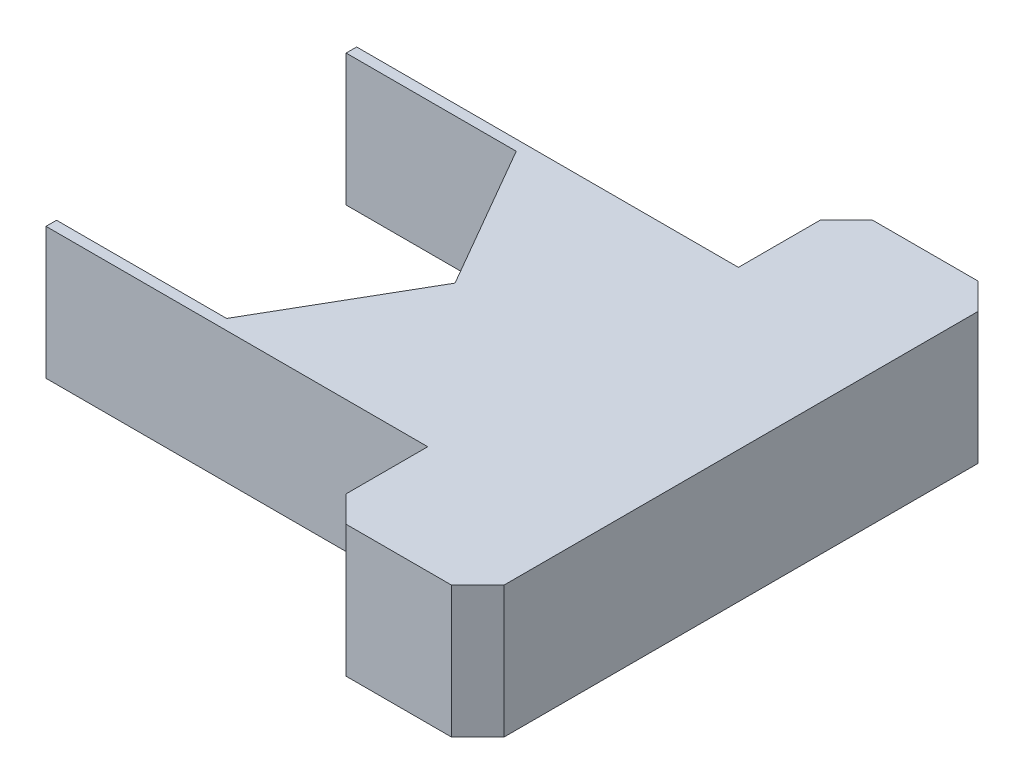
ISO-10303-21;
HEADER;
FILE_DESCRIPTION(('STEP AP214'),'2;1');
FILE_NAME('part.step','',(''),(''),'','','');
FILE_SCHEMA(('AUTOMOTIVE_DESIGN { 1 0 10303 214 1 1 1 1 }'));
ENDSEC;
DATA;
#1=APPLICATION_CONTEXT('core data for automotive mechanical design processes');
#2=APPLICATION_PROTOCOL_DEFINITION('international standard','automotive_design',2000,#1);
#3=PRODUCT_CONTEXT('',#1,'mechanical');
#4=PRODUCT('Part','Part','',(#3));
#5=PRODUCT_RELATED_PRODUCT_CATEGORY('part','',(#4));
#6=PRODUCT_DEFINITION_FORMATION('','',#4);
#7=PRODUCT_DEFINITION_CONTEXT('part definition',#1,'design');
#8=PRODUCT_DEFINITION('design','',#6,#7);
#9=PRODUCT_DEFINITION_SHAPE('','',#8);
#10=(LENGTH_UNIT() NAMED_UNIT(*) SI_UNIT(.MILLI.,.METRE.));
#11=(NAMED_UNIT(*) PLANE_ANGLE_UNIT() SI_UNIT($,.RADIAN.));
#12=(NAMED_UNIT(*) SI_UNIT($,.STERADIAN.) SOLID_ANGLE_UNIT());
#13=UNCERTAINTY_MEASURE_WITH_UNIT(LENGTH_MEASURE(1.E-05),#10,'distance_accuracy_value','');
#14=(GEOMETRIC_REPRESENTATION_CONTEXT(3) GLOBAL_UNCERTAINTY_ASSIGNED_CONTEXT((#13)) GLOBAL_UNIT_ASSIGNED_CONTEXT((#10,
#11,#12)) REPRESENTATION_CONTEXT('',''));
#15=CARTESIAN_POINT('',(0.,0.,0.));
#16=DIRECTION('',(0.,0.,1.));
#17=DIRECTION('',(1.,0.,0.));
#18=AXIS2_PLACEMENT_3D('',#15,#16,#17);
#19=CARTESIAN_POINT('',(2.4378615116532,2.5,-1.4075));
#20=DIRECTION('',(0.866025403784439,0.,-0.5));
#21=DIRECTION('',(-0.5,0.,-0.866025403784439));
#22=AXIS2_PLACEMENT_3D('',#19,#20,#21);
#23=PLANE('',#22);
#24=DIRECTION('',(0.5,0.,0.866025403784439));
#25=VECTOR('',#24,1.);
#26=CARTESIAN_POINT('',(2.4378615116532,0.,-1.4075));
#27=LINE('',#26,#25);
#28=CARTESIAN_POINT('',(1.66276877526612,0.,-2.75));
#29=VERTEX_POINT('',#28);
#30=CARTESIAN_POINT('',(3.2504820155376,0.,0.));
#31=VERTEX_POINT('',#30);
#32=EDGE_CURVE('E195',#29,#31,#27,.T.);
#33=ORIENTED_EDGE('',*,*,#32,.T.);
#34=DIRECTION('',(0.,-1.,0.));
#35=VECTOR('',#34,1.);
#36=CARTESIAN_POINT('',(3.2504820155376,2.5,0.));
#37=LINE('',#36,#35);
#38=CARTESIAN_POINT('',(3.2504820155376,2.5,0.));
#39=VERTEX_POINT('',#38);
#40=EDGE_CURVE('E174',#39,#31,#37,.T.);
#41=ORIENTED_EDGE('',*,*,#40,.F.);
#42=DIRECTION('',(0.5,0.,0.866025403784439));
#43=VECTOR('',#42,1.);
#44=CARTESIAN_POINT('',(2.4378615116532,2.5,-1.4075));
#45=LINE('',#44,#43);
#46=CARTESIAN_POINT('',(1.66276877526612,2.5,-2.75));
#47=VERTEX_POINT('',#46);
#48=EDGE_CURVE('E181',#47,#39,#45,.T.);
#49=ORIENTED_EDGE('',*,*,#48,.F.);
#50=DIRECTION('',(0.,-1.,0.));
#51=VECTOR('',#50,1.);
#52=CARTESIAN_POINT('',(1.66276877526612,2.5,-2.75));
#53=LINE('',#52,#51);
#54=EDGE_CURVE('E283',#47,#29,#53,.T.);
#55=ORIENTED_EDGE('',*,*,#54,.T.);
#56=EDGE_LOOP('',(#33,#41,#49,#55));
#57=FACE_BOUND('',#56,.T.);
#58=ADVANCED_FACE('F47',(#57),#23,.F.);
#59=CARTESIAN_POINT('',(2.4378615116532,2.5,1.4075));
#60=DIRECTION('',(0.866025403784439,0.,0.5));
#61=DIRECTION('',(0.5,0.,-0.866025403784439));
#62=AXIS2_PLACEMENT_3D('',#59,#60,#61);
#63=PLANE('',#62);
#64=DIRECTION('',(-0.5,0.,0.866025403784439));
#65=VECTOR('',#64,1.);
#66=CARTESIAN_POINT('',(2.4378615116532,0.,1.4075));
#67=LINE('',#66,#65);
#68=CARTESIAN_POINT('',(1.66276877526612,0.,2.75));
#69=VERTEX_POINT('',#68);
#70=EDGE_CURVE('E317',#31,#69,#67,.T.);
#71=ORIENTED_EDGE('',*,*,#70,.T.);
#72=DIRECTION('',(0.,-1.,0.));
#73=VECTOR('',#72,1.);
#74=CARTESIAN_POINT('',(1.66276877526612,2.5,2.75));
#75=LINE('',#74,#73);
#76=CARTESIAN_POINT('',(1.66276877526612,2.5,2.75));
#77=VERTEX_POINT('',#76);
#78=EDGE_CURVE('E176',#77,#69,#75,.T.);
#79=ORIENTED_EDGE('',*,*,#78,.F.);
#80=DIRECTION('',(-0.5,0.,0.866025403784439));
#81=VECTOR('',#80,1.);
#82=CARTESIAN_POINT('',(2.4378615116532,2.5,1.4075));
#83=LINE('',#82,#81);
#84=EDGE_CURVE('E169',#39,#77,#83,.T.);
#85=ORIENTED_EDGE('',*,*,#84,.F.);
#86=ORIENTED_EDGE('',*,*,#40,.T.);
#87=EDGE_LOOP('',(#71,#79,#85,#86));
#88=FACE_BOUND('',#87,.T.);
#89=ADVANCED_FACE('F172',(#88),#63,.F.);
#90=CARTESIAN_POINT('',(0.,2.5,2.75));
#91=DIRECTION('',(0.,0.,-1.));
#92=DIRECTION('',(-1.,0.,0.));
#93=AXIS2_PLACEMENT_3D('',#90,#91,#92);
#94=PLANE('',#93);
#95=DIRECTION('',(1.,0.,0.));
#96=VECTOR('',#95,1.);
#97=CARTESIAN_POINT('',(0.,0.,2.75));
#98=LINE('',#97,#96);
#99=CARTESIAN_POINT('',(-1.56750598084984,0.,2.75));
#100=VERTEX_POINT('',#99);
#101=EDGE_CURVE('E314',#100,#69,#98,.T.);
#102=ORIENTED_EDGE('',*,*,#101,.F.);
#103=DIRECTION('',(0.,-1.,0.));
#104=VECTOR('',#103,1.);
#105=CARTESIAN_POINT('',(-1.56750598084984,2.5,2.75));
#106=LINE('',#105,#104);
#107=CARTESIAN_POINT('',(-1.56750598084984,2.5,2.75));
#108=VERTEX_POINT('',#107);
#109=EDGE_CURVE('E203',#108,#100,#106,.T.);
#110=ORIENTED_EDGE('',*,*,#109,.F.);
#111=DIRECTION('',(1.,0.,0.));
#112=VECTOR('',#111,1.);
#113=CARTESIAN_POINT('',(0.,2.5,2.75));
#114=LINE('',#113,#112);
#115=EDGE_CURVE('E180',#108,#77,#114,.T.);
#116=ORIENTED_EDGE('',*,*,#115,.T.);
#117=ORIENTED_EDGE('',*,*,#78,.T.);
#118=EDGE_LOOP('',(#102,#110,#116,#117));
#119=FACE_BOUND('',#118,.T.);
#120=ADVANCED_FACE('F315',(#119),#94,.T.);
#121=CARTESIAN_POINT('',(-1.56750598084984,2.5,0.));
#122=DIRECTION('',(-1.,0.,0.));
#123=DIRECTION('',(0.,0.,1.));
#124=AXIS2_PLACEMENT_3D('',#121,#122,#123);
#125=PLANE('',#124);
#126=DIRECTION('',(0.,0.,-1.));
#127=VECTOR('',#126,1.);
#128=CARTESIAN_POINT('',(-1.56750598084984,0.,0.));
#129=LINE('',#128,#127);
#130=CARTESIAN_POINT('',(-1.56750598084984,0.,2.95));
#131=VERTEX_POINT('',#130);
#132=EDGE_CURVE('E308',#131,#100,#129,.T.);
#133=ORIENTED_EDGE('',*,*,#132,.F.);
#134=DIRECTION('',(0.,-1.,0.));
#135=VECTOR('',#134,1.);
#136=CARTESIAN_POINT('',(-1.56750598084984,2.5,2.95));
#137=LINE('',#136,#135);
#138=CARTESIAN_POINT('',(-1.56750598084984,2.5,2.95));
#139=VERTEX_POINT('',#138);
#140=EDGE_CURVE('E299',#139,#131,#137,.T.);
#141=ORIENTED_EDGE('',*,*,#140,.F.);
#142=DIRECTION('',(0.,0.,-1.));
#143=VECTOR('',#142,1.);
#144=CARTESIAN_POINT('',(-1.56750598084984,2.5,0.));
#145=LINE('',#144,#143);
#146=EDGE_CURVE('E311',#139,#108,#145,.T.);
#147=ORIENTED_EDGE('',*,*,#146,.T.);
#148=ORIENTED_EDGE('',*,*,#109,.T.);
#149=EDGE_LOOP('',(#133,#141,#147,#148));
#150=FACE_BOUND('',#149,.T.);
#151=ADVANCED_FACE('F306',(#150),#125,.T.);
#152=CARTESIAN_POINT('',(0.,2.5,2.95));
#153=DIRECTION('',(0.,0.,1.));
#154=DIRECTION('',(1.,0.,0.));
#155=AXIS2_PLACEMENT_3D('',#152,#153,#154);
#156=PLANE('',#155);
#157=DIRECTION('',(-1.,0.,0.));
#158=VECTOR('',#157,1.);
#159=CARTESIAN_POINT('',(0.,0.,2.95));
#160=LINE('',#159,#158);
#161=CARTESIAN_POINT('',(5.68249401915016,0.,2.95));
#162=VERTEX_POINT('',#161);
#163=EDGE_CURVE('E321',#162,#131,#160,.T.);
#164=ORIENTED_EDGE('',*,*,#163,.F.);
#165=DIRECTION('',(0.,-1.,0.));
#166=VECTOR('',#165,1.);
#167=CARTESIAN_POINT('',(5.68249401915016,2.5,2.95));
#168=LINE('',#167,#166);
#169=CARTESIAN_POINT('',(5.68249401915016,2.5,2.95));
#170=VERTEX_POINT('',#169);
#171=EDGE_CURVE('E296',#170,#162,#168,.T.);
#172=ORIENTED_EDGE('',*,*,#171,.F.);
#173=DIRECTION('',(-1.,0.,0.));
#174=VECTOR('',#173,1.);
#175=CARTESIAN_POINT('',(0.,2.5,2.95));
#176=LINE('',#175,#174);
#177=EDGE_CURVE('E421',#170,#139,#176,.T.);
#178=ORIENTED_EDGE('',*,*,#177,.T.);
#179=ORIENTED_EDGE('',*,*,#140,.T.);
#180=EDGE_LOOP('',(#164,#172,#178,#179));
#181=FACE_BOUND('',#180,.T.);
#182=ADVANCED_FACE('F432',(#181),#156,.T.);
#183=CARTESIAN_POINT('',(5.68249401915016,2.5,0.));
#184=DIRECTION('',(1.,0.,0.));
#185=DIRECTION('',(0.,0.,-1.));
#186=AXIS2_PLACEMENT_3D('',#183,#184,#185);
#187=PLANE('',#186);
#188=DIRECTION('',(0.,0.,1.));
#189=VECTOR('',#188,1.);
#190=CARTESIAN_POINT('',(5.68249401915016,0.,0.));
#191=LINE('',#190,#189);
#192=CARTESIAN_POINT('',(5.68249401915016,0.,4.5));
#193=VERTEX_POINT('',#192);
#194=EDGE_CURVE('E268',#162,#193,#191,.T.);
#195=ORIENTED_EDGE('',*,*,#194,.T.);
#196=DIRECTION('',(0.,1.,0.));
#197=VECTOR('',#196,1.);
#198=CARTESIAN_POINT('',(5.68249401915016,2.5,4.5));
#199=LINE('',#198,#197);
#200=CARTESIAN_POINT('',(5.68249401915016,2.5,4.5));
#201=VERTEX_POINT('',#200);
#202=EDGE_CURVE('E239',#193,#201,#199,.T.);
#203=ORIENTED_EDGE('',*,*,#202,.T.);
#204=DIRECTION('',(0.,0.,1.));
#205=VECTOR('',#204,1.);
#206=CARTESIAN_POINT('',(5.68249401915016,2.5,0.));
#207=LINE('',#206,#205);
#208=EDGE_CURVE('E353',#170,#201,#207,.T.);
#209=ORIENTED_EDGE('',*,*,#208,.F.);
#210=ORIENTED_EDGE('',*,*,#171,.T.);
#211=EDGE_LOOP('',(#195,#203,#209,#210));
#212=FACE_BOUND('',#211,.T.);
#213=ADVANCED_FACE('F433',(#212),#187,.F.);
#214=CARTESIAN_POINT('',(0.,2.5,5.));
#215=DIRECTION('',(0.,0.,-1.));
#216=DIRECTION('',(-1.,0.,0.));
#217=AXIS2_PLACEMENT_3D('',#214,#215,#216);
#218=PLANE('',#217);
#219=DIRECTION('',(1.,0.,0.));
#220=VECTOR('',#219,1.);
#221=CARTESIAN_POINT('',(0.,0.,5.));
#222=LINE('',#221,#220);
#223=CARTESIAN_POINT('',(6.18249401915017,0.,5.));
#224=VERTEX_POINT('',#223);
#225=CARTESIAN_POINT('',(8.18249401915016,0.,5.));
#226=VERTEX_POINT('',#225);
#227=EDGE_CURVE('E269',#224,#226,#222,.T.);
#228=ORIENTED_EDGE('',*,*,#227,.T.);
#229=DIRECTION('',(0.,1.,0.));
#230=VECTOR('',#229,1.);
#231=CARTESIAN_POINT('',(8.18249401915016,2.5,5.));
#232=LINE('',#231,#230);
#233=CARTESIAN_POINT('',(8.18249401915016,2.5,5.));
#234=VERTEX_POINT('',#233);
#235=EDGE_CURVE('E226',#226,#234,#232,.T.);
#236=ORIENTED_EDGE('',*,*,#235,.T.);
#237=DIRECTION('',(1.,0.,0.));
#238=VECTOR('',#237,1.);
#239=CARTESIAN_POINT('',(0.,2.5,5.));
#240=LINE('',#239,#238);
#241=CARTESIAN_POINT('',(6.18249401915017,2.5,5.));
#242=VERTEX_POINT('',#241);
#243=EDGE_CURVE('E343',#242,#234,#240,.T.);
#244=ORIENTED_EDGE('',*,*,#243,.F.);
#245=DIRECTION('',(0.,-1.,0.));
#246=VECTOR('',#245,1.);
#247=CARTESIAN_POINT('',(6.18249401915017,2.5,5.));
#248=LINE('',#247,#246);
#249=EDGE_CURVE('E222',#242,#224,#248,.T.);
#250=ORIENTED_EDGE('',*,*,#249,.T.);
#251=EDGE_LOOP('',(#228,#236,#244,#250));
#252=FACE_BOUND('',#251,.T.);
#253=ADVANCED_FACE('F334',(#252),#218,.F.);
#254=CARTESIAN_POINT('',(8.68249401915016,2.5,0.));
#255=DIRECTION('',(1.,0.,0.));
#256=DIRECTION('',(0.,0.,-1.));
#257=AXIS2_PLACEMENT_3D('',#254,#255,#256);
#258=PLANE('',#257);
#259=DIRECTION('',(0.,0.,1.));
#260=VECTOR('',#259,1.);
#261=CARTESIAN_POINT('',(8.68249401915016,2.5,0.));
#262=LINE('',#261,#260);
#263=CARTESIAN_POINT('',(8.68249401915016,2.5,-4.5));
#264=VERTEX_POINT('',#263);
#265=CARTESIAN_POINT('',(8.68249401915017,2.5,4.5));
#266=VERTEX_POINT('',#265);
#267=EDGE_CURVE('E342',#264,#266,#262,.T.);
#268=ORIENTED_EDGE('',*,*,#267,.T.);
#269=DIRECTION('',(0.,-1.,0.));
#270=VECTOR('',#269,1.);
#271=CARTESIAN_POINT('',(8.68249401915017,0.,4.5));
#272=LINE('',#271,#270);
#273=CARTESIAN_POINT('',(8.68249401915017,0.,4.5));
#274=VERTEX_POINT('',#273);
#275=EDGE_CURVE('E201',#266,#274,#272,.T.);
#276=ORIENTED_EDGE('',*,*,#275,.T.);
#277=DIRECTION('',(0.,0.,1.));
#278=VECTOR('',#277,1.);
#279=CARTESIAN_POINT('',(8.68249401915016,0.,0.));
#280=LINE('',#279,#278);
#281=CARTESIAN_POINT('',(8.68249401915016,0.,-4.5));
#282=VERTEX_POINT('',#281);
#283=EDGE_CURVE('E262',#282,#274,#280,.T.);
#284=ORIENTED_EDGE('',*,*,#283,.F.);
#285=DIRECTION('',(0.,1.,0.));
#286=VECTOR('',#285,1.);
#287=CARTESIAN_POINT('',(8.68249401915016,2.5,-4.5));
#288=LINE('',#287,#286);
#289=EDGE_CURVE('E197',#282,#264,#288,.T.);
#290=ORIENTED_EDGE('',*,*,#289,.T.);
#291=EDGE_LOOP('',(#268,#276,#284,#290));
#292=FACE_BOUND('',#291,.T.);
#293=ADVANCED_FACE('F345',(#292),#258,.T.);
#294=CARTESIAN_POINT('',(0.,2.5,-5.));
#295=DIRECTION('',(0.,0.,-1.));
#296=DIRECTION('',(-1.,0.,0.));
#297=AXIS2_PLACEMENT_3D('',#294,#295,#296);
#298=PLANE('',#297);
#299=DIRECTION('',(1.,0.,0.));
#300=VECTOR('',#299,1.);
#301=CARTESIAN_POINT('',(0.,2.5,-5.));
#302=LINE('',#301,#300);
#303=CARTESIAN_POINT('',(6.18249401915017,2.5,-5.));
#304=VERTEX_POINT('',#303);
#305=CARTESIAN_POINT('',(8.18249401915016,2.5,-5.));
#306=VERTEX_POINT('',#305);
#307=EDGE_CURVE('E253',#304,#306,#302,.T.);
#308=ORIENTED_EDGE('',*,*,#307,.T.);
#309=DIRECTION('',(0.,-1.,0.));
#310=VECTOR('',#309,1.);
#311=CARTESIAN_POINT('',(8.18249401915016,2.5,-5.));
#312=LINE('',#311,#310);
#313=CARTESIAN_POINT('',(8.18249401915016,0.,-5.));
#314=VERTEX_POINT('',#313);
#315=EDGE_CURVE('E57',#306,#314,#312,.T.);
#316=ORIENTED_EDGE('',*,*,#315,.T.);
#317=DIRECTION('',(1.,0.,0.));
#318=VECTOR('',#317,1.);
#319=CARTESIAN_POINT('',(0.,0.,-5.));
#320=LINE('',#319,#318);
#321=CARTESIAN_POINT('',(6.18249401915017,0.,-5.));
#322=VERTEX_POINT('',#321);
#323=EDGE_CURVE('E251',#322,#314,#320,.T.);
#324=ORIENTED_EDGE('',*,*,#323,.F.);
#325=DIRECTION('',(0.,1.,0.));
#326=VECTOR('',#325,1.);
#327=CARTESIAN_POINT('',(6.18249401915017,2.5,-5.));
#328=LINE('',#327,#326);
#329=EDGE_CURVE('E242',#322,#304,#328,.T.);
#330=ORIENTED_EDGE('',*,*,#329,.T.);
#331=EDGE_LOOP('',(#308,#316,#324,#330));
#332=FACE_BOUND('',#331,.T.);
#333=ADVANCED_FACE('F250',(#332),#298,.T.);
#334=CARTESIAN_POINT('',(5.68249401915016,2.5,-4.5));
#335=VERTEX_POINT('',#334);
#336=CARTESIAN_POINT('',(5.68249401915016,2.5,-2.95));
#337=VERTEX_POINT('',#336);
#338=EDGE_CURVE('E351',#335,#337,#207,.T.);
#339=ORIENTED_EDGE('',*,*,#338,.F.);
#340=DIRECTION('',(0.,-1.,0.));
#341=VECTOR('',#340,1.);
#342=CARTESIAN_POINT('',(5.68249401915016,0.,-4.5));
#343=LINE('',#342,#341);
#344=CARTESIAN_POINT('',(5.68249401915016,0.,-4.5));
#345=VERTEX_POINT('',#344);
#346=EDGE_CURVE('E11',#335,#345,#343,.T.);
#347=ORIENTED_EDGE('',*,*,#346,.T.);
#348=CARTESIAN_POINT('',(5.68249401915016,0.,-2.95));
#349=VERTEX_POINT('',#348);
#350=EDGE_CURVE('E261',#345,#349,#191,.T.);
#351=ORIENTED_EDGE('',*,*,#350,.T.);
#352=DIRECTION('',(0.,-1.,0.));
#353=VECTOR('',#352,1.);
#354=CARTESIAN_POINT('',(5.68249401915016,2.5,-2.95));
#355=LINE('',#354,#353);
#356=EDGE_CURVE('E292',#337,#349,#355,.T.);
#357=ORIENTED_EDGE('',*,*,#356,.F.);
#358=EDGE_LOOP('',(#339,#347,#351,#357));
#359=FACE_BOUND('',#358,.T.);
#360=ADVANCED_FACE('F381',(#359),#187,.F.);
#361=CARTESIAN_POINT('',(0.,2.5,-2.95));
#362=DIRECTION('',(0.,0.,-1.));
#363=DIRECTION('',(-1.,0.,0.));
#364=AXIS2_PLACEMENT_3D('',#361,#362,#363);
#365=PLANE('',#364);
#366=DIRECTION('',(1.,0.,0.));
#367=VECTOR('',#366,1.);
#368=CARTESIAN_POINT('',(0.,0.,-2.95));
#369=LINE('',#368,#367);
#370=CARTESIAN_POINT('',(-1.56750598084984,0.,-2.95));
#371=VERTEX_POINT('',#370);
#372=EDGE_CURVE('E266',#371,#349,#369,.T.);
#373=ORIENTED_EDGE('',*,*,#372,.F.);
#374=DIRECTION('',(0.,-1.,0.));
#375=VECTOR('',#374,1.);
#376=CARTESIAN_POINT('',(-1.56750598084984,2.5,-2.95));
#377=LINE('',#376,#375);
#378=CARTESIAN_POINT('',(-1.56750598084984,2.5,-2.95));
#379=VERTEX_POINT('',#378);
#380=EDGE_CURVE('E289',#379,#371,#377,.T.);
#381=ORIENTED_EDGE('',*,*,#380,.F.);
#382=DIRECTION('',(1.,0.,0.));
#383=VECTOR('',#382,1.);
#384=CARTESIAN_POINT('',(0.,2.5,-2.95));
#385=LINE('',#384,#383);
#386=EDGE_CURVE('E357',#379,#337,#385,.T.);
#387=ORIENTED_EDGE('',*,*,#386,.T.);
#388=ORIENTED_EDGE('',*,*,#356,.T.);
#389=EDGE_LOOP('',(#373,#381,#387,#388));
#390=FACE_BOUND('',#389,.T.);
#391=ADVANCED_FACE('F377',(#390),#365,.T.);
#392=CARTESIAN_POINT('',(-1.56750598084984,2.5,0.));
#393=DIRECTION('',(-1.,0.,0.));
#394=DIRECTION('',(0.,0.,1.));
#395=AXIS2_PLACEMENT_3D('',#392,#393,#394);
#396=PLANE('',#395);
#397=DIRECTION('',(0.,0.,-1.));
#398=VECTOR('',#397,1.);
#399=CARTESIAN_POINT('',(-1.56750598084984,0.,0.));
#400=LINE('',#399,#398);
#401=CARTESIAN_POINT('',(-1.56750598084984,0.,-2.75));
#402=VERTEX_POINT('',#401);
#403=EDGE_CURVE('E276',#402,#371,#400,.T.);
#404=ORIENTED_EDGE('',*,*,#403,.F.);
#405=DIRECTION('',(0.,-1.,0.));
#406=VECTOR('',#405,1.);
#407=CARTESIAN_POINT('',(-1.56750598084984,2.5,-2.75));
#408=LINE('',#407,#406);
#409=CARTESIAN_POINT('',(-1.56750598084984,2.5,-2.75));
#410=VERTEX_POINT('',#409);
#411=EDGE_CURVE('E286',#410,#402,#408,.T.);
#412=ORIENTED_EDGE('',*,*,#411,.F.);
#413=DIRECTION('',(0.,0.,-1.));
#414=VECTOR('',#413,1.);
#415=CARTESIAN_POINT('',(-1.56750598084984,2.5,0.));
#416=LINE('',#415,#414);
#417=EDGE_CURVE('E361',#410,#379,#416,.T.);
#418=ORIENTED_EDGE('',*,*,#417,.T.);
#419=ORIENTED_EDGE('',*,*,#380,.T.);
#420=EDGE_LOOP('',(#404,#412,#418,#419));
#421=FACE_BOUND('',#420,.T.);
#422=ADVANCED_FACE('F374',(#421),#396,.T.);
#423=CARTESIAN_POINT('',(0.,2.5,-2.75));
#424=DIRECTION('',(0.,0.,1.));
#425=DIRECTION('',(1.,0.,0.));
#426=AXIS2_PLACEMENT_3D('',#423,#424,#425);
#427=PLANE('',#426);
#428=DIRECTION('',(-1.,0.,0.));
#429=VECTOR('',#428,1.);
#430=CARTESIAN_POINT('',(0.,0.,-2.75));
#431=LINE('',#430,#429);
#432=EDGE_CURVE('E192',#29,#402,#431,.T.);
#433=ORIENTED_EDGE('',*,*,#432,.F.);
#434=ORIENTED_EDGE('',*,*,#54,.F.);
#435=DIRECTION('',(-1.,0.,0.));
#436=VECTOR('',#435,1.);
#437=CARTESIAN_POINT('',(0.,2.5,-2.75));
#438=LINE('',#437,#436);
#439=EDGE_CURVE('E189',#47,#410,#438,.T.);
#440=ORIENTED_EDGE('',*,*,#439,.T.);
#441=ORIENTED_EDGE('',*,*,#411,.T.);
#442=EDGE_LOOP('',(#433,#434,#440,#441));
#443=FACE_BOUND('',#442,.T.);
#444=ADVANCED_FACE('F371',(#443),#427,.T.);
#445=CARTESIAN_POINT('',(0.,2.5,0.));
#446=DIRECTION('',(0.,1.,0.));
#447=DIRECTION('',(0.,0.,1.));
#448=AXIS2_PLACEMENT_3D('',#445,#446,#447);
#449=PLANE('',#448);
#450=ORIENTED_EDGE('',*,*,#243,.T.);
#451=DIRECTION('',(0.707106781186549,0.,-0.707106781186546));
#452=VECTOR('',#451,1.);
#453=CARTESIAN_POINT('',(6.59124700957507,2.5,6.59124700957509));
#454=LINE('',#453,#452);
#455=EDGE_CURVE('E236',#234,#266,#454,.T.);
#456=ORIENTED_EDGE('',*,*,#455,.T.);
#457=ORIENTED_EDGE('',*,*,#267,.F.);
#458=DIRECTION('',(0.707106781186546,0.,0.707106781186549));
#459=VECTOR('',#458,1.);
#460=CARTESIAN_POINT('',(6.59124700957509,2.5,-6.59124700957507));
#461=LINE('',#460,#459);
#462=EDGE_CURVE('E70',#264,#306,#461,.F.);
#463=ORIENTED_EDGE('',*,*,#462,.T.);
#464=ORIENTED_EDGE('',*,*,#307,.F.);
#465=DIRECTION('',(-0.707106781186551,0.,0.707106781186544));
#466=VECTOR('',#465,1.);
#467=CARTESIAN_POINT('',(0.591247009575056,2.5,0.591247009575062));
#468=LINE('',#467,#466);
#469=EDGE_CURVE('E64',#304,#335,#468,.T.);
#470=ORIENTED_EDGE('',*,*,#469,.T.);
#471=ORIENTED_EDGE('',*,*,#338,.T.);
#472=ORIENTED_EDGE('',*,*,#386,.F.);
#473=ORIENTED_EDGE('',*,*,#417,.F.);
#474=ORIENTED_EDGE('',*,*,#439,.F.);
#475=ORIENTED_EDGE('',*,*,#48,.T.);
#476=ORIENTED_EDGE('',*,*,#84,.T.);
#477=ORIENTED_EDGE('',*,*,#115,.F.);
#478=ORIENTED_EDGE('',*,*,#146,.F.);
#479=ORIENTED_EDGE('',*,*,#177,.F.);
#480=ORIENTED_EDGE('',*,*,#208,.T.);
#481=DIRECTION('',(-0.707106781186546,0.,-0.707106781186549));
#482=VECTOR('',#481,1.);
#483=CARTESIAN_POINT('',(0.591247009575093,2.5,-0.591247009575091));
#484=LINE('',#483,#482);
#485=EDGE_CURVE('E233',#201,#242,#484,.F.);
#486=ORIENTED_EDGE('',*,*,#485,.T.);
#487=EDGE_LOOP('',(#450,#456,#457,#463,#464,#470,#471,#472,#473,#474,#475,#476,#477,#478,#479,
#480,#486));
#488=FACE_BOUND('',#487,.T.);
#489=ADVANCED_FACE('F186',(#488),#449,.T.);
#490=CARTESIAN_POINT('',(0.,0.,0.));
#491=DIRECTION('',(0.,1.,0.));
#492=DIRECTION('',(0.,0.,1.));
#493=AXIS2_PLACEMENT_3D('',#490,#491,#492);
#494=PLANE('',#493);
#495=ORIENTED_EDGE('',*,*,#283,.T.);
#496=DIRECTION('',(-0.707106781186549,0.,0.707106781186546));
#497=VECTOR('',#496,1.);
#498=CARTESIAN_POINT('',(8.68249401915017,0.,4.5));
#499=LINE('',#498,#497);
#500=EDGE_CURVE('E219',#274,#226,#499,.T.);
#501=ORIENTED_EDGE('',*,*,#500,.T.);
#502=ORIENTED_EDGE('',*,*,#227,.F.);
#503=DIRECTION('',(0.707106781186546,0.,0.707106781186549));
#504=VECTOR('',#503,1.);
#505=CARTESIAN_POINT('',(6.18249401915017,0.,5.));
#506=LINE('',#505,#504);
#507=EDGE_CURVE('E216',#224,#193,#506,.F.);
#508=ORIENTED_EDGE('',*,*,#507,.T.);
#509=ORIENTED_EDGE('',*,*,#194,.F.);
#510=ORIENTED_EDGE('',*,*,#163,.T.);
#511=ORIENTED_EDGE('',*,*,#132,.T.);
#512=ORIENTED_EDGE('',*,*,#101,.T.);
#513=ORIENTED_EDGE('',*,*,#70,.F.);
#514=ORIENTED_EDGE('',*,*,#32,.F.);
#515=ORIENTED_EDGE('',*,*,#432,.T.);
#516=ORIENTED_EDGE('',*,*,#403,.T.);
#517=ORIENTED_EDGE('',*,*,#372,.T.);
#518=ORIENTED_EDGE('',*,*,#350,.F.);
#519=DIRECTION('',(0.707106781186551,0.,-0.707106781186544));
#520=VECTOR('',#519,1.);
#521=CARTESIAN_POINT('',(5.68249401915016,0.,-4.5));
#522=LINE('',#521,#520);
#523=EDGE_CURVE('E210',#345,#322,#522,.T.);
#524=ORIENTED_EDGE('',*,*,#523,.T.);
#525=ORIENTED_EDGE('',*,*,#323,.T.);
#526=DIRECTION('',(-0.707106781186546,0.,-0.707106781186549));
#527=VECTOR('',#526,1.);
#528=CARTESIAN_POINT('',(8.18249401915016,0.,-5.));
#529=LINE('',#528,#527);
#530=EDGE_CURVE('E213',#314,#282,#529,.F.);
#531=ORIENTED_EDGE('',*,*,#530,.T.);
#532=EDGE_LOOP('',(#495,#501,#502,#508,#509,#510,#511,#512,#513,#514,#515,#516,#517,#518,#524,
#525,#531));
#533=FACE_BOUND('',#532,.T.);
#534=ADVANCED_FACE('F257',(#533),#494,.F.);
#535=CARTESIAN_POINT('',(8.68249401915017,2.5,4.5));
#536=DIRECTION('',(0.707106781186546,0.,0.707106781186549));
#537=DIRECTION('',(0.,1.,0.));
#538=AXIS2_PLACEMENT_3D('',#535,#536,#537);
#539=PLANE('',#538);
#540=ORIENTED_EDGE('',*,*,#455,.F.);
#541=ORIENTED_EDGE('',*,*,#235,.F.);
#542=ORIENTED_EDGE('',*,*,#500,.F.);
#543=ORIENTED_EDGE('',*,*,#275,.F.);
#544=EDGE_LOOP('',(#540,#541,#542,#543));
#545=FACE_BOUND('',#544,.T.);
#546=ADVANCED_FACE('F339',(#545),#539,.T.);
#547=CARTESIAN_POINT('',(6.18249401915017,2.5,5.));
#548=DIRECTION('',(0.707106781186549,0.,-0.707106781186546));
#549=DIRECTION('',(0.,-1.,0.));
#550=AXIS2_PLACEMENT_3D('',#547,#548,#549);
#551=PLANE('',#550);
#552=ORIENTED_EDGE('',*,*,#485,.F.);
#553=ORIENTED_EDGE('',*,*,#202,.F.);
#554=ORIENTED_EDGE('',*,*,#507,.F.);
#555=ORIENTED_EDGE('',*,*,#249,.F.);
#556=EDGE_LOOP('',(#552,#553,#554,#555));
#557=FACE_BOUND('',#556,.T.);
#558=ADVANCED_FACE('F389',(#557),#551,.F.);
#559=CARTESIAN_POINT('',(8.18249401915016,2.5,-5.));
#560=DIRECTION('',(-0.707106781186549,0.,0.707106781186546));
#561=DIRECTION('',(0.,-1.,0.));
#562=AXIS2_PLACEMENT_3D('',#559,#560,#561);
#563=PLANE('',#562);
#564=ORIENTED_EDGE('',*,*,#462,.F.);
#565=ORIENTED_EDGE('',*,*,#289,.F.);
#566=ORIENTED_EDGE('',*,*,#530,.F.);
#567=ORIENTED_EDGE('',*,*,#315,.F.);
#568=EDGE_LOOP('',(#564,#565,#566,#567));
#569=FACE_BOUND('',#568,.T.);
#570=ADVANCED_FACE('F385',(#569),#563,.F.);
#571=CARTESIAN_POINT('',(5.68249401915016,2.5,-4.5));
#572=DIRECTION('',(-0.707106781186544,0.,-0.70710678118655));
#573=DIRECTION('',(0.,1.,0.));
#574=AXIS2_PLACEMENT_3D('',#571,#572,#573);
#575=PLANE('',#574);
#576=ORIENTED_EDGE('',*,*,#469,.F.);
#577=ORIENTED_EDGE('',*,*,#329,.F.);
#578=ORIENTED_EDGE('',*,*,#523,.F.);
#579=ORIENTED_EDGE('',*,*,#346,.F.);
#580=EDGE_LOOP('',(#576,#577,#578,#579));
#581=FACE_BOUND('',#580,.T.);
#582=ADVANCED_FACE('F50',(#581),#575,.T.);
#583=CLOSED_SHELL('',(#58,#89,#120,#151,#182,#213,#253,#293,#333,#360,#391,#422,#444,#489,#534,
#546,#558,#570,#582));
#584=MANIFOLD_SOLID_BREP('B2',#583);
#585=ADVANCED_BREP_SHAPE_REPRESENTATION('',(#18,#584),#14);
#586=SHAPE_DEFINITION_REPRESENTATION(#9,#585);
ENDSEC;
END-ISO-10303-21;
